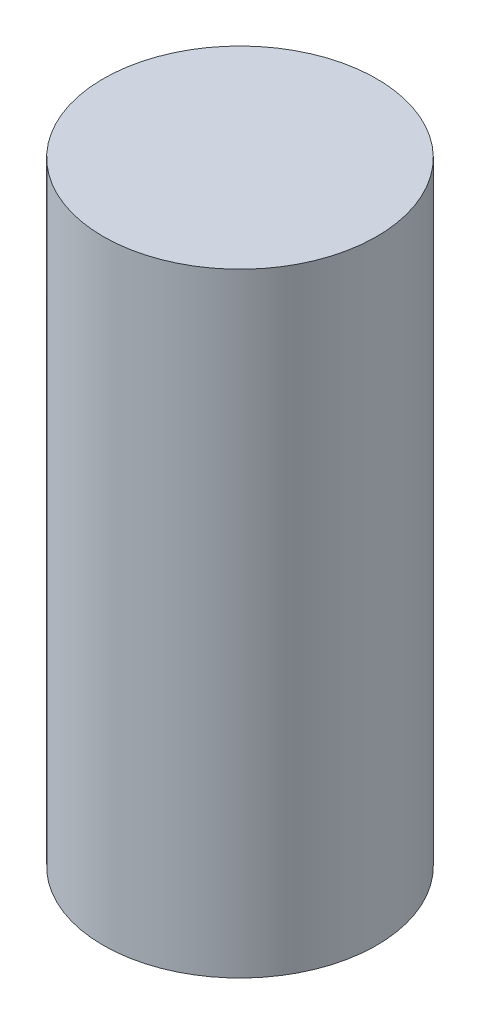
ISO-10303-21;
HEADER;
FILE_DESCRIPTION(('STEP AP214'),'2;1');
FILE_NAME('part.step','',(''),(''),'','','');
FILE_SCHEMA(('AUTOMOTIVE_DESIGN { 1 0 10303 214 1 1 1 1 }'));
ENDSEC;
DATA;
#1=APPLICATION_CONTEXT('core data for automotive mechanical design processes');
#2=APPLICATION_PROTOCOL_DEFINITION('international standard','automotive_design',2000,#1);
#3=PRODUCT_CONTEXT('',#1,'mechanical');
#4=PRODUCT('Part','Part','',(#3));
#5=PRODUCT_RELATED_PRODUCT_CATEGORY('part','',(#4));
#6=PRODUCT_DEFINITION_FORMATION('','',#4);
#7=PRODUCT_DEFINITION_CONTEXT('part definition',#1,'design');
#8=PRODUCT_DEFINITION('design','',#6,#7);
#9=PRODUCT_DEFINITION_SHAPE('','',#8);
#10=(LENGTH_UNIT() NAMED_UNIT(*) SI_UNIT(.MILLI.,.METRE.));
#11=(NAMED_UNIT(*) PLANE_ANGLE_UNIT() SI_UNIT($,.RADIAN.));
#12=(NAMED_UNIT(*) SI_UNIT($,.STERADIAN.) SOLID_ANGLE_UNIT());
#13=UNCERTAINTY_MEASURE_WITH_UNIT(LENGTH_MEASURE(1.E-05),#10,'distance_accuracy_value','');
#14=(GEOMETRIC_REPRESENTATION_CONTEXT(3) GLOBAL_UNCERTAINTY_ASSIGNED_CONTEXT((#13)) GLOBAL_UNIT_ASSIGNED_CONTEXT((#10,
#11,#12)) REPRESENTATION_CONTEXT('',''));
#15=CARTESIAN_POINT('',(0.,0.,0.));
#16=DIRECTION('',(0.,0.,1.));
#17=DIRECTION('',(1.,0.,0.));
#18=AXIS2_PLACEMENT_3D('',#15,#16,#17);
#19=CARTESIAN_POINT('',(0.,27.94,0.));
#20=DIRECTION('',(0.,-1.,0.));
#21=DIRECTION('',(0.,0.,-1.));
#22=AXIS2_PLACEMENT_3D('',#19,#20,#21);
#23=CYLINDRICAL_SURFACE('',#22,6.223);
#24=CARTESIAN_POINT('',(0.,27.94,0.));
#25=DIRECTION('',(0.,1.,0.));
#26=DIRECTION('',(0.,0.,1.));
#27=AXIS2_PLACEMENT_3D('',#24,#25,#26);
#28=CIRCLE('',#27,6.223);
#29=CARTESIAN_POINT('',(0.,27.94,6.223));
#30=VERTEX_POINT('',#29);
#31=EDGE_CURVE('E10',#30,#30,#28,.T.);
#32=ORIENTED_EDGE('',*,*,#31,.F.);
#33=EDGE_LOOP('',(#32));
#34=FACE_BOUND('',#33,.T.);
#35=CARTESIAN_POINT('',(0.,0.,0.));
#36=DIRECTION('',(0.,1.,0.));
#37=DIRECTION('',(0.,0.,1.));
#38=AXIS2_PLACEMENT_3D('',#35,#36,#37);
#39=CIRCLE('',#38,6.223);
#40=CARTESIAN_POINT('',(0.,0.,6.223));
#41=VERTEX_POINT('',#40);
#42=EDGE_CURVE('E34',#41,#41,#39,.T.);
#43=ORIENTED_EDGE('',*,*,#42,.T.);
#44=EDGE_LOOP('',(#43));
#45=FACE_BOUND('',#44,.T.);
#46=ADVANCED_FACE('F31',(#34,#45),#23,.T.);
#47=CARTESIAN_POINT('',(0.,27.94,0.));
#48=DIRECTION('',(0.,1.,0.));
#49=DIRECTION('',(0.,0.,1.));
#50=AXIS2_PLACEMENT_3D('',#47,#48,#49);
#51=PLANE('',#50);
#52=ORIENTED_EDGE('',*,*,#31,.T.);
#53=EDGE_LOOP('',(#52));
#54=FACE_BOUND('',#53,.T.);
#55=ADVANCED_FACE('F46',(#54),#51,.T.);
#56=CARTESIAN_POINT('',(0.,0.,0.));
#57=DIRECTION('',(0.,1.,0.));
#58=DIRECTION('',(0.,0.,1.));
#59=AXIS2_PLACEMENT_3D('',#56,#57,#58);
#60=PLANE('',#59);
#61=ORIENTED_EDGE('',*,*,#42,.F.);
#62=EDGE_LOOP('',(#61));
#63=FACE_BOUND('',#62,.T.);
#64=ADVANCED_FACE('F44',(#63),#60,.F.);
#65=CLOSED_SHELL('',(#46,#55,#64));
#66=MANIFOLD_SOLID_BREP('B2',#65);
#67=ADVANCED_BREP_SHAPE_REPRESENTATION('',(#18,#66),#14);
#68=SHAPE_DEFINITION_REPRESENTATION(#9,#67);
ENDSEC;
END-ISO-10303-21;
